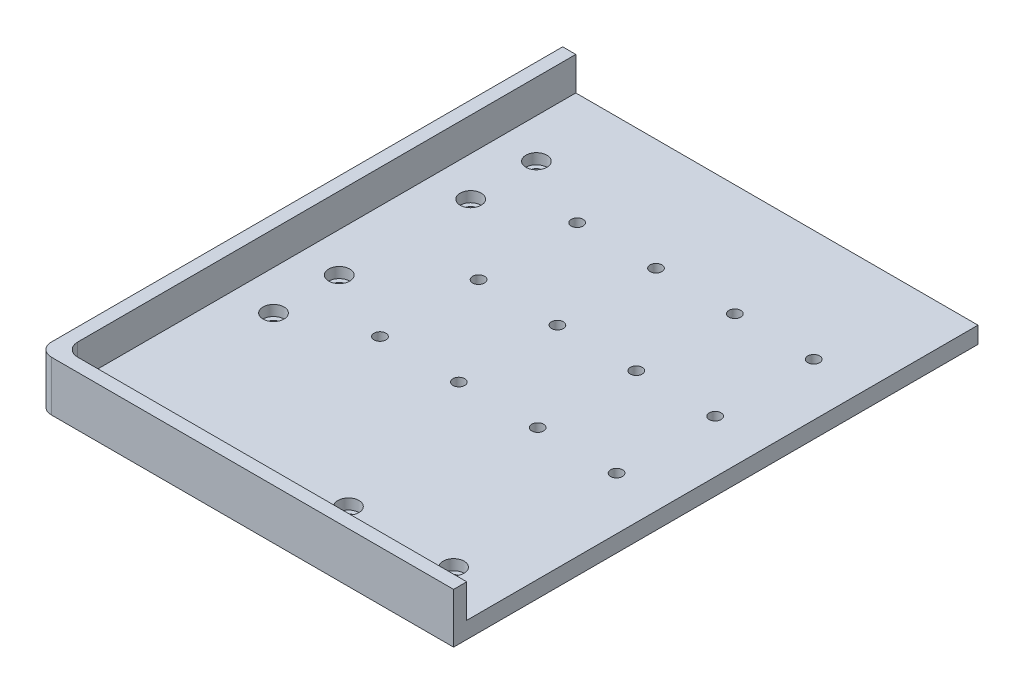
ISO-10303-21;
HEADER;
FILE_DESCRIPTION(('STEP AP214'),'2;1');
FILE_NAME('part.step','',(''),(''),'','','');
FILE_SCHEMA(('AUTOMOTIVE_DESIGN { 1 0 10303 214 1 1 1 1 }'));
ENDSEC;
DATA;
#1=APPLICATION_CONTEXT('core data for automotive mechanical design processes');
#2=APPLICATION_PROTOCOL_DEFINITION('international standard','automotive_design',2000,#1);
#3=PRODUCT_CONTEXT('',#1,'mechanical');
#4=PRODUCT('Part','Part','',(#3));
#5=PRODUCT_RELATED_PRODUCT_CATEGORY('part','',(#4));
#6=PRODUCT_DEFINITION_FORMATION('','',#4);
#7=PRODUCT_DEFINITION_CONTEXT('part definition',#1,'design');
#8=PRODUCT_DEFINITION('design','',#6,#7);
#9=PRODUCT_DEFINITION_SHAPE('','',#8);
#10=(LENGTH_UNIT() NAMED_UNIT(*) SI_UNIT(.MILLI.,.METRE.));
#11=(NAMED_UNIT(*) PLANE_ANGLE_UNIT() SI_UNIT($,.RADIAN.));
#12=(NAMED_UNIT(*) SI_UNIT($,.STERADIAN.) SOLID_ANGLE_UNIT());
#13=UNCERTAINTY_MEASURE_WITH_UNIT(LENGTH_MEASURE(1.E-05),#10,'distance_accuracy_value','');
#14=(GEOMETRIC_REPRESENTATION_CONTEXT(3) GLOBAL_UNCERTAINTY_ASSIGNED_CONTEXT((#13)) GLOBAL_UNIT_ASSIGNED_CONTEXT((#10,
#11,#12)) REPRESENTATION_CONTEXT('',''));
#15=CARTESIAN_POINT('',(0.,0.,0.));
#16=DIRECTION('',(0.,0.,1.));
#17=DIRECTION('',(1.,0.,0.));
#18=AXIS2_PLACEMENT_3D('',#15,#16,#17);
#19=CARTESIAN_POINT('',(48.,6.35,42.5));
#20=DIRECTION('',(0.,1.,0.));
#21=DIRECTION('',(0.,0.,1.));
#22=AXIS2_PLACEMENT_3D('',#19,#20,#21);
#23=CYLINDRICAL_SURFACE('',#22,2.25);
#24=CARTESIAN_POINT('',(48.,0.,42.5));
#25=DIRECTION('',(0.,1.,0.));
#26=DIRECTION('',(0.,0.,1.));
#27=AXIS2_PLACEMENT_3D('',#24,#25,#26);
#28=CIRCLE('',#27,2.25);
#29=CARTESIAN_POINT('',(48.,0.,44.75));
#30=VERTEX_POINT('',#29);
#31=EDGE_CURVE('E219',#30,#30,#28,.T.);
#32=ORIENTED_EDGE('',*,*,#31,.F.);
#33=EDGE_LOOP('',(#32));
#34=FACE_BOUND('',#33,.T.);
#35=CARTESIAN_POINT('',(48.,6.35,42.5));
#36=DIRECTION('',(0.,1.,0.));
#37=DIRECTION('',(0.,0.,1.));
#38=AXIS2_PLACEMENT_3D('',#35,#36,#37);
#39=CIRCLE('',#38,2.25);
#40=CARTESIAN_POINT('',(48.,6.35,44.75));
#41=VERTEX_POINT('',#40);
#42=EDGE_CURVE('E222',#41,#41,#39,.T.);
#43=ORIENTED_EDGE('',*,*,#42,.T.);
#44=EDGE_LOOP('',(#43));
#45=FACE_BOUND('',#44,.T.);
#46=ADVANCED_FACE('F41',(#34,#45),#23,.F.);
#47=CARTESIAN_POINT('',(78.,6.35,42.5));
#48=DIRECTION('',(0.,1.,0.));
#49=DIRECTION('',(0.,0.,1.));
#50=AXIS2_PLACEMENT_3D('',#47,#48,#49);
#51=CYLINDRICAL_SURFACE('',#50,2.25);
#52=CARTESIAN_POINT('',(78.,0.,42.5));
#53=DIRECTION('',(0.,1.,0.));
#54=DIRECTION('',(0.,0.,1.));
#55=AXIS2_PLACEMENT_3D('',#52,#53,#54);
#56=CIRCLE('',#55,2.25);
#57=CARTESIAN_POINT('',(78.,0.,44.75));
#58=VERTEX_POINT('',#57);
#59=EDGE_CURVE('E213',#58,#58,#56,.T.);
#60=ORIENTED_EDGE('',*,*,#59,.F.);
#61=EDGE_LOOP('',(#60));
#62=FACE_BOUND('',#61,.T.);
#63=CARTESIAN_POINT('',(78.,6.35,42.5));
#64=DIRECTION('',(0.,1.,0.));
#65=DIRECTION('',(0.,0.,1.));
#66=AXIS2_PLACEMENT_3D('',#63,#64,#65);
#67=CIRCLE('',#66,2.25);
#68=CARTESIAN_POINT('',(78.,6.35,44.75));
#69=VERTEX_POINT('',#68);
#70=EDGE_CURVE('E216',#69,#69,#67,.T.);
#71=ORIENTED_EDGE('',*,*,#70,.T.);
#72=EDGE_LOOP('',(#71));
#73=FACE_BOUND('',#72,.T.);
#74=ADVANCED_FACE('F251',(#62,#73),#51,.F.);
#75=CARTESIAN_POINT('',(108.,6.35,42.5));
#76=DIRECTION('',(0.,1.,0.));
#77=DIRECTION('',(0.,0.,1.));
#78=AXIS2_PLACEMENT_3D('',#75,#76,#77);
#79=CYLINDRICAL_SURFACE('',#78,2.25);
#80=CARTESIAN_POINT('',(108.,0.,42.5));
#81=DIRECTION('',(0.,1.,0.));
#82=DIRECTION('',(0.,0.,1.));
#83=AXIS2_PLACEMENT_3D('',#80,#81,#82);
#84=CIRCLE('',#83,2.25);
#85=CARTESIAN_POINT('',(108.,0.,44.75));
#86=VERTEX_POINT('',#85);
#87=EDGE_CURVE('E207',#86,#86,#84,.T.);
#88=ORIENTED_EDGE('',*,*,#87,.F.);
#89=EDGE_LOOP('',(#88));
#90=FACE_BOUND('',#89,.T.);
#91=CARTESIAN_POINT('',(108.,6.35,42.5));
#92=DIRECTION('',(0.,1.,0.));
#93=DIRECTION('',(0.,0.,1.));
#94=AXIS2_PLACEMENT_3D('',#91,#92,#93);
#95=CIRCLE('',#94,2.25);
#96=CARTESIAN_POINT('',(108.,6.35,44.75));
#97=VERTEX_POINT('',#96);
#98=EDGE_CURVE('E210',#97,#97,#95,.T.);
#99=ORIENTED_EDGE('',*,*,#98,.T.);
#100=EDGE_LOOP('',(#99));
#101=FACE_BOUND('',#100,.T.);
#102=ADVANCED_FACE('F258',(#90,#101),#79,.F.);
#103=CARTESIAN_POINT('',(138.,6.35,42.5));
#104=DIRECTION('',(0.,1.,0.));
#105=DIRECTION('',(0.,0.,1.));
#106=AXIS2_PLACEMENT_3D('',#103,#104,#105);
#107=CYLINDRICAL_SURFACE('',#106,2.25);
#108=CARTESIAN_POINT('',(138.,0.,42.5));
#109=DIRECTION('',(0.,1.,0.));
#110=DIRECTION('',(0.,0.,1.));
#111=AXIS2_PLACEMENT_3D('',#108,#109,#110);
#112=CIRCLE('',#111,2.25);
#113=CARTESIAN_POINT('',(138.,0.,44.75));
#114=VERTEX_POINT('',#113);
#115=EDGE_CURVE('E201',#114,#114,#112,.T.);
#116=ORIENTED_EDGE('',*,*,#115,.F.);
#117=EDGE_LOOP('',(#116));
#118=FACE_BOUND('',#117,.T.);
#119=CARTESIAN_POINT('',(138.,6.35,42.5));
#120=DIRECTION('',(0.,1.,0.));
#121=DIRECTION('',(0.,0.,1.));
#122=AXIS2_PLACEMENT_3D('',#119,#120,#121);
#123=CIRCLE('',#122,2.25);
#124=CARTESIAN_POINT('',(138.,6.35,44.75));
#125=VERTEX_POINT('',#124);
#126=EDGE_CURVE('E204',#125,#125,#123,.T.);
#127=ORIENTED_EDGE('',*,*,#126,.T.);
#128=EDGE_LOOP('',(#127));
#129=FACE_BOUND('',#128,.T.);
#130=ADVANCED_FACE('F266',(#118,#129),#107,.F.);
#131=CARTESIAN_POINT('',(48.0000000000001,6.35,80.));
#132=DIRECTION('',(0.,1.,0.));
#133=DIRECTION('',(0.,0.,1.));
#134=AXIS2_PLACEMENT_3D('',#131,#132,#133);
#135=CYLINDRICAL_SURFACE('',#134,2.25);
#136=CARTESIAN_POINT('',(48.0000000000001,0.,80.));
#137=DIRECTION('',(0.,1.,0.));
#138=DIRECTION('',(0.,0.,1.));
#139=AXIS2_PLACEMENT_3D('',#136,#137,#138);
#140=CIRCLE('',#139,2.25);
#141=CARTESIAN_POINT('',(48.0000000000001,0.,82.25));
#142=VERTEX_POINT('',#141);
#143=EDGE_CURVE('E195',#142,#142,#140,.T.);
#144=ORIENTED_EDGE('',*,*,#143,.F.);
#145=EDGE_LOOP('',(#144));
#146=FACE_BOUND('',#145,.T.);
#147=CARTESIAN_POINT('',(48.0000000000001,6.35,80.));
#148=DIRECTION('',(0.,1.,0.));
#149=DIRECTION('',(0.,0.,1.));
#150=AXIS2_PLACEMENT_3D('',#147,#148,#149);
#151=CIRCLE('',#150,2.25);
#152=CARTESIAN_POINT('',(48.0000000000001,6.35,82.25));
#153=VERTEX_POINT('',#152);
#154=EDGE_CURVE('E198',#153,#153,#151,.T.);
#155=ORIENTED_EDGE('',*,*,#154,.T.);
#156=EDGE_LOOP('',(#155));
#157=FACE_BOUND('',#156,.T.);
#158=ADVANCED_FACE('F270',(#146,#157),#135,.F.);
#159=CARTESIAN_POINT('',(138.,6.35,80.));
#160=DIRECTION('',(0.,1.,0.));
#161=DIRECTION('',(0.,0.,1.));
#162=AXIS2_PLACEMENT_3D('',#159,#160,#161);
#163=CYLINDRICAL_SURFACE('',#162,2.25);
#164=CARTESIAN_POINT('',(138.,0.,80.));
#165=DIRECTION('',(0.,1.,0.));
#166=DIRECTION('',(0.,0.,1.));
#167=AXIS2_PLACEMENT_3D('',#164,#165,#166);
#168=CIRCLE('',#167,2.25);
#169=CARTESIAN_POINT('',(138.,0.,82.25));
#170=VERTEX_POINT('',#169);
#171=EDGE_CURVE('E189',#170,#170,#168,.T.);
#172=ORIENTED_EDGE('',*,*,#171,.F.);
#173=EDGE_LOOP('',(#172));
#174=FACE_BOUND('',#173,.T.);
#175=CARTESIAN_POINT('',(138.,6.35,80.));
#176=DIRECTION('',(0.,1.,0.));
#177=DIRECTION('',(0.,0.,1.));
#178=AXIS2_PLACEMENT_3D('',#175,#176,#177);
#179=CIRCLE('',#178,2.25);
#180=CARTESIAN_POINT('',(138.,6.35,82.25));
#181=VERTEX_POINT('',#180);
#182=EDGE_CURVE('E192',#181,#181,#179,.T.);
#183=ORIENTED_EDGE('',*,*,#182,.T.);
#184=EDGE_LOOP('',(#183));
#185=FACE_BOUND('',#184,.T.);
#186=ADVANCED_FACE('F274',(#174,#185),#163,.F.);
#187=CARTESIAN_POINT('',(48.0000000000001,6.35,117.5));
#188=DIRECTION('',(0.,1.,0.));
#189=DIRECTION('',(0.,0.,1.));
#190=AXIS2_PLACEMENT_3D('',#187,#188,#189);
#191=CYLINDRICAL_SURFACE('',#190,2.25);
#192=CARTESIAN_POINT('',(48.0000000000001,0.,117.5));
#193=DIRECTION('',(0.,1.,0.));
#194=DIRECTION('',(0.,0.,1.));
#195=AXIS2_PLACEMENT_3D('',#192,#193,#194);
#196=CIRCLE('',#195,2.25);
#197=CARTESIAN_POINT('',(48.0000000000001,0.,119.75));
#198=VERTEX_POINT('',#197);
#199=EDGE_CURVE('E183',#198,#198,#196,.T.);
#200=ORIENTED_EDGE('',*,*,#199,.F.);
#201=EDGE_LOOP('',(#200));
#202=FACE_BOUND('',#201,.T.);
#203=CARTESIAN_POINT('',(48.0000000000001,6.35,117.5));
#204=DIRECTION('',(0.,1.,0.));
#205=DIRECTION('',(0.,0.,1.));
#206=AXIS2_PLACEMENT_3D('',#203,#204,#205);
#207=CIRCLE('',#206,2.25);
#208=CARTESIAN_POINT('',(48.0000000000001,6.35,119.75));
#209=VERTEX_POINT('',#208);
#210=EDGE_CURVE('E186',#209,#209,#207,.T.);
#211=ORIENTED_EDGE('',*,*,#210,.T.);
#212=EDGE_LOOP('',(#211));
#213=FACE_BOUND('',#212,.T.);
#214=ADVANCED_FACE('F278',(#202,#213),#191,.F.);
#215=CARTESIAN_POINT('',(78.0000000000001,6.35,117.5));
#216=DIRECTION('',(0.,1.,0.));
#217=DIRECTION('',(0.,0.,1.));
#218=AXIS2_PLACEMENT_3D('',#215,#216,#217);
#219=CYLINDRICAL_SURFACE('',#218,2.25);
#220=CARTESIAN_POINT('',(78.0000000000001,0.,117.5));
#221=DIRECTION('',(0.,1.,0.));
#222=DIRECTION('',(0.,0.,1.));
#223=AXIS2_PLACEMENT_3D('',#220,#221,#222);
#224=CIRCLE('',#223,2.25);
#225=CARTESIAN_POINT('',(78.0000000000001,0.,119.75));
#226=VERTEX_POINT('',#225);
#227=EDGE_CURVE('E177',#226,#226,#224,.T.);
#228=ORIENTED_EDGE('',*,*,#227,.F.);
#229=EDGE_LOOP('',(#228));
#230=FACE_BOUND('',#229,.T.);
#231=CARTESIAN_POINT('',(78.0000000000001,6.35,117.5));
#232=DIRECTION('',(0.,1.,0.));
#233=DIRECTION('',(0.,0.,1.));
#234=AXIS2_PLACEMENT_3D('',#231,#232,#233);
#235=CIRCLE('',#234,2.25);
#236=CARTESIAN_POINT('',(78.0000000000001,6.35,119.75));
#237=VERTEX_POINT('',#236);
#238=EDGE_CURVE('E180',#237,#237,#235,.T.);
#239=ORIENTED_EDGE('',*,*,#238,.T.);
#240=EDGE_LOOP('',(#239));
#241=FACE_BOUND('',#240,.T.);
#242=ADVANCED_FACE('F282',(#230,#241),#219,.F.);
#243=CARTESIAN_POINT('',(78.0000000000001,6.35,80.));
#244=DIRECTION('',(0.,1.,0.));
#245=DIRECTION('',(0.,0.,1.));
#246=AXIS2_PLACEMENT_3D('',#243,#244,#245);
#247=CYLINDRICAL_SURFACE('',#246,2.25);
#248=CARTESIAN_POINT('',(78.0000000000001,0.,80.));
#249=DIRECTION('',(0.,1.,0.));
#250=DIRECTION('',(0.,0.,1.));
#251=AXIS2_PLACEMENT_3D('',#248,#249,#250);
#252=CIRCLE('',#251,2.25);
#253=CARTESIAN_POINT('',(78.0000000000001,0.,82.25));
#254=VERTEX_POINT('',#253);
#255=EDGE_CURVE('E171',#254,#254,#252,.T.);
#256=ORIENTED_EDGE('',*,*,#255,.F.);
#257=EDGE_LOOP('',(#256));
#258=FACE_BOUND('',#257,.T.);
#259=CARTESIAN_POINT('',(78.0000000000001,6.35,80.));
#260=DIRECTION('',(0.,1.,0.));
#261=DIRECTION('',(0.,0.,1.));
#262=AXIS2_PLACEMENT_3D('',#259,#260,#261);
#263=CIRCLE('',#262,2.25);
#264=CARTESIAN_POINT('',(78.0000000000001,6.35,82.25));
#265=VERTEX_POINT('',#264);
#266=EDGE_CURVE('E174',#265,#265,#263,.T.);
#267=ORIENTED_EDGE('',*,*,#266,.T.);
#268=EDGE_LOOP('',(#267));
#269=FACE_BOUND('',#268,.T.);
#270=ADVANCED_FACE('F286',(#258,#269),#247,.F.);
#271=CARTESIAN_POINT('',(0.,6.35,0.));
#272=DIRECTION('',(1.,0.,0.));
#273=DIRECTION('',(0.,0.,-1.));
#274=AXIS2_PLACEMENT_3D('',#271,#272,#273);
#275=PLANE('',#274);
#276=DIRECTION('',(0.,0.,1.));
#277=VECTOR('',#276,1.);
#278=CARTESIAN_POINT('',(0.,0.,0.));
#279=LINE('',#278,#277);
#280=CARTESIAN_POINT('',(0.,0.,0.));
#281=VERTEX_POINT('',#280);
#282=CARTESIAN_POINT('',(0.,0.,194.5));
#283=VERTEX_POINT('',#282);
#284=EDGE_CURVE('E156',#281,#283,#279,.T.);
#285=ORIENTED_EDGE('',*,*,#284,.T.);
#286=DIRECTION('',(0.,-1.,0.));
#287=VECTOR('',#286,1.);
#288=CARTESIAN_POINT('',(0.,6.35,194.5));
#289=LINE('',#288,#287);
#290=CARTESIAN_POINT('',(0.,19.05,194.5));
#291=VERTEX_POINT('',#290);
#292=EDGE_CURVE('E56',#283,#291,#289,.F.);
#293=ORIENTED_EDGE('',*,*,#292,.T.);
#294=DIRECTION('',(0.,0.,1.));
#295=VECTOR('',#294,1.);
#296=CARTESIAN_POINT('',(0.,19.05,0.));
#297=LINE('',#296,#295);
#298=CARTESIAN_POINT('',(0.,19.05,0.));
#299=VERTEX_POINT('',#298);
#300=EDGE_CURVE('E124',#299,#291,#297,.T.);
#301=ORIENTED_EDGE('',*,*,#300,.F.);
#302=DIRECTION('',(0.,-1.,0.));
#303=VECTOR('',#302,1.);
#304=CARTESIAN_POINT('',(0.,6.35,0.));
#305=LINE('',#304,#303);
#306=EDGE_CURVE('E113',#299,#281,#305,.T.);
#307=ORIENTED_EDGE('',*,*,#306,.T.);
#308=EDGE_LOOP('',(#285,#293,#301,#307));
#309=FACE_BOUND('',#308,.T.);
#310=ADVANCED_FACE('F125',(#309),#275,.F.);
#311=CARTESIAN_POINT('',(0.,6.35,199.5));
#312=DIRECTION('',(0.,0.,-1.));
#313=DIRECTION('',(-1.,0.,0.));
#314=AXIS2_PLACEMENT_3D('',#311,#312,#313);
#315=PLANE('',#314);
#316=DIRECTION('',(1.,0.,0.));
#317=VECTOR('',#316,1.);
#318=CARTESIAN_POINT('',(0.,19.05,199.5));
#319=LINE('',#318,#317);
#320=CARTESIAN_POINT('',(5.00000000000005,19.05,199.5));
#321=VERTEX_POINT('',#320);
#322=CARTESIAN_POINT('',(158.,19.05,199.5));
#323=VERTEX_POINT('',#322);
#324=EDGE_CURVE('E128',#321,#323,#319,.T.);
#325=ORIENTED_EDGE('',*,*,#324,.F.);
#326=DIRECTION('',(0.,-1.,0.));
#327=VECTOR('',#326,1.);
#328=CARTESIAN_POINT('',(5.00000000000005,6.35,199.5));
#329=LINE('',#328,#327);
#330=CARTESIAN_POINT('',(5.00000000000005,0.,199.5));
#331=VERTEX_POINT('',#330);
#332=EDGE_CURVE('E232',#321,#331,#329,.T.);
#333=ORIENTED_EDGE('',*,*,#332,.T.);
#334=DIRECTION('',(1.,0.,0.));
#335=VECTOR('',#334,1.);
#336=CARTESIAN_POINT('',(0.,0.,199.5));
#337=LINE('',#336,#335);
#338=CARTESIAN_POINT('',(158.,0.,199.5));
#339=VERTEX_POINT('',#338);
#340=EDGE_CURVE('E162',#331,#339,#337,.T.);
#341=ORIENTED_EDGE('',*,*,#340,.T.);
#342=DIRECTION('',(0.,-1.,0.));
#343=VECTOR('',#342,1.);
#344=CARTESIAN_POINT('',(158.,6.35,199.5));
#345=LINE('',#344,#343);
#346=EDGE_CURVE('E168',#323,#339,#345,.T.);
#347=ORIENTED_EDGE('',*,*,#346,.F.);
#348=EDGE_LOOP('',(#325,#333,#341,#347));
#349=FACE_BOUND('',#348,.T.);
#350=ADVANCED_FACE('F241',(#349),#315,.F.);
#351=CARTESIAN_POINT('',(158.,6.35,0.));
#352=DIRECTION('',(-1.,0.,0.));
#353=DIRECTION('',(0.,0.,1.));
#354=AXIS2_PLACEMENT_3D('',#351,#352,#353);
#355=PLANE('',#354);
#356=DIRECTION('',(0.,0.,-1.));
#357=VECTOR('',#356,1.);
#358=CARTESIAN_POINT('',(158.,0.,0.));
#359=LINE('',#358,#357);
#360=CARTESIAN_POINT('',(158.,0.,0.));
#361=VERTEX_POINT('',#360);
#362=EDGE_CURVE('E164',#339,#361,#359,.T.);
#363=ORIENTED_EDGE('',*,*,#362,.T.);
#364=DIRECTION('',(0.,-1.,0.));
#365=VECTOR('',#364,1.);
#366=CARTESIAN_POINT('',(158.,6.35,0.));
#367=LINE('',#366,#365);
#368=CARTESIAN_POINT('',(158.,6.35,0.));
#369=VERTEX_POINT('',#368);
#370=EDGE_CURVE('E121',#369,#361,#367,.T.);
#371=ORIENTED_EDGE('',*,*,#370,.F.);
#372=DIRECTION('',(0.,0.,-1.));
#373=VECTOR('',#372,1.);
#374=CARTESIAN_POINT('',(158.,6.35,0.));
#375=LINE('',#374,#373);
#376=CARTESIAN_POINT('',(158.,6.35,194.5));
#377=VERTEX_POINT('',#376);
#378=EDGE_CURVE('E157',#377,#369,#375,.T.);
#379=ORIENTED_EDGE('',*,*,#378,.F.);
#380=DIRECTION('',(0.,-1.,0.));
#381=VECTOR('',#380,1.);
#382=CARTESIAN_POINT('',(158.,19.05,194.5));
#383=LINE('',#382,#381);
#384=CARTESIAN_POINT('',(158.,19.05,194.5));
#385=VERTEX_POINT('',#384);
#386=EDGE_CURVE('E153',#385,#377,#383,.T.);
#387=ORIENTED_EDGE('',*,*,#386,.F.);
#388=DIRECTION('',(0.,0.,-1.));
#389=VECTOR('',#388,1.);
#390=CARTESIAN_POINT('',(158.,19.05,199.5));
#391=LINE('',#390,#389);
#392=EDGE_CURVE('E143',#323,#385,#391,.T.);
#393=ORIENTED_EDGE('',*,*,#392,.F.);
#394=ORIENTED_EDGE('',*,*,#346,.T.);
#395=EDGE_LOOP('',(#363,#371,#379,#387,#393,#394));
#396=FACE_BOUND('',#395,.T.);
#397=ADVANCED_FACE('F295',(#396),#355,.F.);
#398=CARTESIAN_POINT('',(0.,6.35,0.));
#399=DIRECTION('',(0.,0.,1.));
#400=DIRECTION('',(1.,0.,0.));
#401=AXIS2_PLACEMENT_3D('',#398,#399,#400);
#402=PLANE('',#401);
#403=DIRECTION('',(-1.,0.,0.));
#404=VECTOR('',#403,1.);
#405=CARTESIAN_POINT('',(0.,0.,0.));
#406=LINE('',#405,#404);
#407=EDGE_CURVE('E120',#361,#281,#406,.T.);
#408=ORIENTED_EDGE('',*,*,#407,.T.);
#409=ORIENTED_EDGE('',*,*,#306,.F.);
#410=DIRECTION('',(-1.,0.,0.));
#411=VECTOR('',#410,1.);
#412=CARTESIAN_POINT('',(0.,19.05,0.));
#413=LINE('',#412,#411);
#414=CARTESIAN_POINT('',(5.,19.05,0.));
#415=VERTEX_POINT('',#414);
#416=EDGE_CURVE('E117',#415,#299,#413,.T.);
#417=ORIENTED_EDGE('',*,*,#416,.F.);
#418=DIRECTION('',(0.,-1.,0.));
#419=VECTOR('',#418,1.);
#420=CARTESIAN_POINT('',(5.,19.05,0.));
#421=LINE('',#420,#419);
#422=CARTESIAN_POINT('',(5.,6.35,0.));
#423=VERTEX_POINT('',#422);
#424=EDGE_CURVE('E149',#415,#423,#421,.T.);
#425=ORIENTED_EDGE('',*,*,#424,.T.);
#426=DIRECTION('',(-1.,0.,0.));
#427=VECTOR('',#426,1.);
#428=CARTESIAN_POINT('',(0.,6.35,0.));
#429=LINE('',#428,#427);
#430=EDGE_CURVE('E122',#369,#423,#429,.T.);
#431=ORIENTED_EDGE('',*,*,#430,.F.);
#432=ORIENTED_EDGE('',*,*,#370,.T.);
#433=EDGE_LOOP('',(#408,#409,#417,#425,#431,#432));
#434=FACE_BOUND('',#433,.T.);
#435=ADVANCED_FACE('F114',(#434),#402,.F.);
#436=CARTESIAN_POINT('',(0.,6.35,0.));
#437=DIRECTION('',(0.,1.,0.));
#438=DIRECTION('',(0.,0.,1.));
#439=AXIS2_PLACEMENT_3D('',#436,#437,#438);
#440=PLANE('',#439);
#441=CARTESIAN_POINT('',(108.,6.35,117.5));
#442=DIRECTION('',(0.,1.,0.));
#443=DIRECTION('',(0.,0.,1.));
#444=AXIS2_PLACEMENT_3D('',#441,#442,#443);
#445=CIRCLE('',#444,2.25);
#446=CARTESIAN_POINT('',(108.,6.35,119.75));
#447=VERTEX_POINT('',#446);
#448=EDGE_CURVE('E408',#447,#447,#445,.T.);
#449=ORIENTED_EDGE('',*,*,#448,.F.);
#450=EDGE_LOOP('',(#449));
#451=FACE_BOUND('',#450,.T.);
#452=CARTESIAN_POINT('',(108.,6.35,80.));
#453=DIRECTION('',(0.,1.,0.));
#454=DIRECTION('',(0.,0.,1.));
#455=AXIS2_PLACEMENT_3D('',#452,#453,#454);
#456=CIRCLE('',#455,2.25);
#457=CARTESIAN_POINT('',(108.,6.35,82.25));
#458=VERTEX_POINT('',#457);
#459=EDGE_CURVE('E412',#458,#458,#456,.T.);
#460=ORIENTED_EDGE('',*,*,#459,.F.);
#461=EDGE_LOOP('',(#460));
#462=FACE_BOUND('',#461,.T.);
#463=CARTESIAN_POINT('',(138.,6.35,117.5));
#464=DIRECTION('',(0.,1.,0.));
#465=DIRECTION('',(0.,0.,1.));
#466=AXIS2_PLACEMENT_3D('',#463,#464,#465);
#467=CIRCLE('',#466,2.25);
#468=CARTESIAN_POINT('',(138.,6.35,119.75));
#469=VERTEX_POINT('',#468);
#470=EDGE_CURVE('E418',#469,#469,#467,.T.);
#471=ORIENTED_EDGE('',*,*,#470,.F.);
#472=EDGE_LOOP('',(#471));
#473=FACE_BOUND('',#472,.T.);
#474=CARTESIAN_POINT('',(98.,6.35,179.5));
#475=DIRECTION('',(0.,1.,0.));
#476=DIRECTION('',(0.,0.,1.));
#477=AXIS2_PLACEMENT_3D('',#474,#475,#476);
#478=CIRCLE('',#477,4.);
#479=CARTESIAN_POINT('',(98.,6.35,183.5));
#480=VERTEX_POINT('',#479);
#481=EDGE_CURVE('E424',#480,#480,#478,.T.);
#482=ORIENTED_EDGE('',*,*,#481,.F.);
#483=EDGE_LOOP('',(#482));
#484=FACE_BOUND('',#483,.T.);
#485=CARTESIAN_POINT('',(138.,6.35,179.5));
#486=DIRECTION('',(0.,1.,0.));
#487=DIRECTION('',(0.,0.,1.));
#488=AXIS2_PLACEMENT_3D('',#485,#486,#487);
#489=CIRCLE('',#488,4.);
#490=CARTESIAN_POINT('',(138.,6.35,183.5));
#491=VERTEX_POINT('',#490);
#492=EDGE_CURVE('E436',#491,#491,#489,.T.);
#493=ORIENTED_EDGE('',*,*,#492,.F.);
#494=EDGE_LOOP('',(#493));
#495=FACE_BOUND('',#494,.T.);
#496=CARTESIAN_POINT('',(20.,6.35,130.));
#497=DIRECTION('',(0.,1.,0.));
#498=DIRECTION('',(0.,0.,1.));
#499=AXIS2_PLACEMENT_3D('',#496,#497,#498);
#500=CIRCLE('',#499,4.);
#501=CARTESIAN_POINT('',(20.,6.35,134.));
#502=VERTEX_POINT('',#501);
#503=EDGE_CURVE('E448',#502,#502,#500,.T.);
#504=ORIENTED_EDGE('',*,*,#503,.F.);
#505=EDGE_LOOP('',(#504));
#506=FACE_BOUND('',#505,.T.);
#507=CARTESIAN_POINT('',(20.,6.35,105.));
#508=DIRECTION('',(0.,1.,0.));
#509=DIRECTION('',(0.,0.,1.));
#510=AXIS2_PLACEMENT_3D('',#507,#508,#509);
#511=CIRCLE('',#510,4.);
#512=CARTESIAN_POINT('',(20.,6.35,109.));
#513=VERTEX_POINT('',#512);
#514=EDGE_CURVE('E460',#513,#513,#511,.T.);
#515=ORIENTED_EDGE('',*,*,#514,.F.);
#516=EDGE_LOOP('',(#515));
#517=FACE_BOUND('',#516,.T.);
#518=CARTESIAN_POINT('',(20.,6.35,30.));
#519=DIRECTION('',(0.,1.,0.));
#520=DIRECTION('',(0.,0.,1.));
#521=AXIS2_PLACEMENT_3D('',#518,#519,#520);
#522=CIRCLE('',#521,4.);
#523=CARTESIAN_POINT('',(20.,6.35,34.));
#524=VERTEX_POINT('',#523);
#525=EDGE_CURVE('E472',#524,#524,#522,.T.);
#526=ORIENTED_EDGE('',*,*,#525,.F.);
#527=EDGE_LOOP('',(#526));
#528=FACE_BOUND('',#527,.T.);
#529=CARTESIAN_POINT('',(20.,6.35,55.));
#530=DIRECTION('',(0.,1.,0.));
#531=DIRECTION('',(0.,0.,1.));
#532=AXIS2_PLACEMENT_3D('',#529,#530,#531);
#533=CIRCLE('',#532,4.);
#534=CARTESIAN_POINT('',(20.,6.35,59.));
#535=VERTEX_POINT('',#534);
#536=EDGE_CURVE('E484',#535,#535,#533,.T.);
#537=ORIENTED_EDGE('',*,*,#536,.F.);
#538=EDGE_LOOP('',(#537));
#539=FACE_BOUND('',#538,.T.);
#540=DIRECTION('',(0.,0.,-1.));
#541=VECTOR('',#540,1.);
#542=CARTESIAN_POINT('',(5.,6.35,0.));
#543=LINE('',#542,#541);
#544=CARTESIAN_POINT('',(5.,6.35,189.5));
#545=VERTEX_POINT('',#544);
#546=EDGE_CURVE('E134',#545,#423,#543,.T.);
#547=ORIENTED_EDGE('',*,*,#546,.F.);
#548=CARTESIAN_POINT('',(10.,6.35,189.5));
#549=DIRECTION('',(0.,1.,0.));
#550=DIRECTION('',(0.,0.,1.));
#551=AXIS2_PLACEMENT_3D('',#548,#549,#550);
#552=CIRCLE('',#551,5.);
#553=CARTESIAN_POINT('',(10.,6.35,194.5));
#554=VERTEX_POINT('',#553);
#555=EDGE_CURVE('E228',#545,#554,#552,.T.);
#556=ORIENTED_EDGE('',*,*,#555,.T.);
#557=DIRECTION('',(-1.,0.,0.));
#558=VECTOR('',#557,1.);
#559=CARTESIAN_POINT('',(5.,6.35,194.5));
#560=LINE('',#559,#558);
#561=EDGE_CURVE('E136',#377,#554,#560,.T.);
#562=ORIENTED_EDGE('',*,*,#561,.F.);
#563=ORIENTED_EDGE('',*,*,#378,.T.);
#564=ORIENTED_EDGE('',*,*,#430,.T.);
#565=EDGE_LOOP('',(#547,#556,#562,#563,#564));
#566=FACE_BOUND('',#565,.T.);
#567=ORIENTED_EDGE('',*,*,#266,.F.);
#568=EDGE_LOOP('',(#567));
#569=FACE_BOUND('',#568,.T.);
#570=ORIENTED_EDGE('',*,*,#238,.F.);
#571=EDGE_LOOP('',(#570));
#572=FACE_BOUND('',#571,.T.);
#573=ORIENTED_EDGE('',*,*,#210,.F.);
#574=EDGE_LOOP('',(#573));
#575=FACE_BOUND('',#574,.T.);
#576=ORIENTED_EDGE('',*,*,#182,.F.);
#577=EDGE_LOOP('',(#576));
#578=FACE_BOUND('',#577,.T.);
#579=ORIENTED_EDGE('',*,*,#154,.F.);
#580=EDGE_LOOP('',(#579));
#581=FACE_BOUND('',#580,.T.);
#582=ORIENTED_EDGE('',*,*,#126,.F.);
#583=EDGE_LOOP('',(#582));
#584=FACE_BOUND('',#583,.T.);
#585=ORIENTED_EDGE('',*,*,#98,.F.);
#586=EDGE_LOOP('',(#585));
#587=FACE_BOUND('',#586,.T.);
#588=ORIENTED_EDGE('',*,*,#70,.F.);
#589=EDGE_LOOP('',(#588));
#590=FACE_BOUND('',#589,.T.);
#591=ORIENTED_EDGE('',*,*,#42,.F.);
#592=EDGE_LOOP('',(#591));
#593=FACE_BOUND('',#592,.T.);
#594=ADVANCED_FACE('F301',(#451,#462,#473,#484,#495,#506,#517,#528,#539,#566,#569,#572,#575,
#578,#581,#584,#587,#590,#593),#440,.T.);
#595=CARTESIAN_POINT('',(0.,0.,0.));
#596=DIRECTION('',(0.,1.,0.));
#597=DIRECTION('',(0.,0.,1.));
#598=AXIS2_PLACEMENT_3D('',#595,#596,#597);
#599=PLANE('',#598);
#600=CARTESIAN_POINT('',(108.,0.,117.5));
#601=DIRECTION('',(0.,1.,0.));
#602=DIRECTION('',(0.,0.,1.));
#603=AXIS2_PLACEMENT_3D('',#600,#601,#602);
#604=CIRCLE('',#603,2.25);
#605=CARTESIAN_POINT('',(108.,0.,119.75));
#606=VERTEX_POINT('',#605);
#607=EDGE_CURVE('E405',#606,#606,#604,.T.);
#608=ORIENTED_EDGE('',*,*,#607,.T.);
#609=EDGE_LOOP('',(#608));
#610=FACE_BOUND('',#609,.T.);
#611=CARTESIAN_POINT('',(108.,0.,80.));
#612=DIRECTION('',(0.,1.,0.));
#613=DIRECTION('',(0.,0.,1.));
#614=AXIS2_PLACEMENT_3D('',#611,#612,#613);
#615=CIRCLE('',#614,2.25);
#616=CARTESIAN_POINT('',(108.,0.,82.25));
#617=VERTEX_POINT('',#616);
#618=EDGE_CURVE('E409',#617,#617,#615,.T.);
#619=ORIENTED_EDGE('',*,*,#618,.T.);
#620=EDGE_LOOP('',(#619));
#621=FACE_BOUND('',#620,.T.);
#622=CARTESIAN_POINT('',(138.,0.,117.5));
#623=DIRECTION('',(0.,1.,0.));
#624=DIRECTION('',(0.,0.,1.));
#625=AXIS2_PLACEMENT_3D('',#622,#623,#624);
#626=CIRCLE('',#625,2.25);
#627=CARTESIAN_POINT('',(138.,0.,119.75));
#628=VERTEX_POINT('',#627);
#629=EDGE_CURVE('E421',#628,#628,#626,.T.);
#630=ORIENTED_EDGE('',*,*,#629,.T.);
#631=EDGE_LOOP('',(#630));
#632=FACE_BOUND('',#631,.T.);
#633=CARTESIAN_POINT('',(98.,0.,179.5));
#634=DIRECTION('',(0.,1.,0.));
#635=DIRECTION('',(0.,0.,1.));
#636=AXIS2_PLACEMENT_3D('',#633,#634,#635);
#637=CIRCLE('',#636,2.25);
#638=CARTESIAN_POINT('',(98.,0.,181.75));
#639=VERTEX_POINT('',#638);
#640=EDGE_CURVE('E433',#639,#639,#637,.T.);
#641=ORIENTED_EDGE('',*,*,#640,.T.);
#642=EDGE_LOOP('',(#641));
#643=FACE_BOUND('',#642,.T.);
#644=CARTESIAN_POINT('',(138.,0.,179.5));
#645=DIRECTION('',(0.,1.,0.));
#646=DIRECTION('',(0.,0.,1.));
#647=AXIS2_PLACEMENT_3D('',#644,#645,#646);
#648=CIRCLE('',#647,2.25);
#649=CARTESIAN_POINT('',(138.,0.,181.75));
#650=VERTEX_POINT('',#649);
#651=EDGE_CURVE('E445',#650,#650,#648,.T.);
#652=ORIENTED_EDGE('',*,*,#651,.T.);
#653=EDGE_LOOP('',(#652));
#654=FACE_BOUND('',#653,.T.);
#655=CARTESIAN_POINT('',(20.,0.,130.));
#656=DIRECTION('',(0.,1.,0.));
#657=DIRECTION('',(0.,0.,1.));
#658=AXIS2_PLACEMENT_3D('',#655,#656,#657);
#659=CIRCLE('',#658,2.25);
#660=CARTESIAN_POINT('',(20.,0.,132.25));
#661=VERTEX_POINT('',#660);
#662=EDGE_CURVE('E457',#661,#661,#659,.T.);
#663=ORIENTED_EDGE('',*,*,#662,.T.);
#664=EDGE_LOOP('',(#663));
#665=FACE_BOUND('',#664,.T.);
#666=CARTESIAN_POINT('',(20.,0.,105.));
#667=DIRECTION('',(0.,1.,0.));
#668=DIRECTION('',(0.,0.,1.));
#669=AXIS2_PLACEMENT_3D('',#666,#667,#668);
#670=CIRCLE('',#669,2.25);
#671=CARTESIAN_POINT('',(20.,0.,107.25));
#672=VERTEX_POINT('',#671);
#673=EDGE_CURVE('E469',#672,#672,#670,.T.);
#674=ORIENTED_EDGE('',*,*,#673,.T.);
#675=EDGE_LOOP('',(#674));
#676=FACE_BOUND('',#675,.T.);
#677=CARTESIAN_POINT('',(20.,0.,30.));
#678=DIRECTION('',(0.,1.,0.));
#679=DIRECTION('',(0.,0.,1.));
#680=AXIS2_PLACEMENT_3D('',#677,#678,#679);
#681=CIRCLE('',#680,2.25);
#682=CARTESIAN_POINT('',(20.,0.,32.25));
#683=VERTEX_POINT('',#682);
#684=EDGE_CURVE('E481',#683,#683,#681,.T.);
#685=ORIENTED_EDGE('',*,*,#684,.T.);
#686=EDGE_LOOP('',(#685));
#687=FACE_BOUND('',#686,.T.);
#688=CARTESIAN_POINT('',(20.,0.,55.));
#689=DIRECTION('',(0.,1.,0.));
#690=DIRECTION('',(0.,0.,1.));
#691=AXIS2_PLACEMENT_3D('',#688,#689,#690);
#692=CIRCLE('',#691,2.25);
#693=CARTESIAN_POINT('',(20.,0.,57.25));
#694=VERTEX_POINT('',#693);
#695=EDGE_CURVE('E139',#694,#694,#692,.T.);
#696=ORIENTED_EDGE('',*,*,#695,.T.);
#697=EDGE_LOOP('',(#696));
#698=FACE_BOUND('',#697,.T.);
#699=ORIENTED_EDGE('',*,*,#340,.F.);
#700=CARTESIAN_POINT('',(5.00000000000005,0.,194.5));
#701=DIRECTION('',(0.,1.,0.));
#702=DIRECTION('',(0.,0.,1.));
#703=AXIS2_PLACEMENT_3D('',#700,#701,#702);
#704=CIRCLE('',#703,5.);
#705=EDGE_CURVE('E64',#331,#283,#704,.F.);
#706=ORIENTED_EDGE('',*,*,#705,.T.);
#707=ORIENTED_EDGE('',*,*,#284,.F.);
#708=ORIENTED_EDGE('',*,*,#407,.F.);
#709=ORIENTED_EDGE('',*,*,#362,.F.);
#710=EDGE_LOOP('',(#699,#706,#707,#708,#709));
#711=FACE_BOUND('',#710,.T.);
#712=ORIENTED_EDGE('',*,*,#255,.T.);
#713=EDGE_LOOP('',(#712));
#714=FACE_BOUND('',#713,.T.);
#715=ORIENTED_EDGE('',*,*,#227,.T.);
#716=EDGE_LOOP('',(#715));
#717=FACE_BOUND('',#716,.T.);
#718=ORIENTED_EDGE('',*,*,#199,.T.);
#719=EDGE_LOOP('',(#718));
#720=FACE_BOUND('',#719,.T.);
#721=ORIENTED_EDGE('',*,*,#171,.T.);
#722=EDGE_LOOP('',(#721));
#723=FACE_BOUND('',#722,.T.);
#724=ORIENTED_EDGE('',*,*,#143,.T.);
#725=EDGE_LOOP('',(#724));
#726=FACE_BOUND('',#725,.T.);
#727=ORIENTED_EDGE('',*,*,#115,.T.);
#728=EDGE_LOOP('',(#727));
#729=FACE_BOUND('',#728,.T.);
#730=ORIENTED_EDGE('',*,*,#87,.T.);
#731=EDGE_LOOP('',(#730));
#732=FACE_BOUND('',#731,.T.);
#733=ORIENTED_EDGE('',*,*,#59,.T.);
#734=EDGE_LOOP('',(#733));
#735=FACE_BOUND('',#734,.T.);
#736=ORIENTED_EDGE('',*,*,#31,.T.);
#737=EDGE_LOOP('',(#736));
#738=FACE_BOUND('',#737,.T.);
#739=ADVANCED_FACE('F302',(#610,#621,#632,#643,#654,#665,#676,#687,#698,#711,#714,#717,#720,
#723,#726,#729,#732,#735,#738),#599,.F.);
#740=CARTESIAN_POINT('',(5.,19.05,194.5));
#741=DIRECTION('',(0.,0.,1.));
#742=DIRECTION('',(1.,0.,0.));
#743=AXIS2_PLACEMENT_3D('',#740,#741,#742);
#744=PLANE('',#743);
#745=ORIENTED_EDGE('',*,*,#561,.T.);
#746=DIRECTION('',(0.,-1.,0.));
#747=VECTOR('',#746,1.);
#748=CARTESIAN_POINT('',(10.,19.05,194.5));
#749=LINE('',#748,#747);
#750=CARTESIAN_POINT('',(10.,19.05,194.5));
#751=VERTEX_POINT('',#750);
#752=EDGE_CURVE('E230',#554,#751,#749,.F.);
#753=ORIENTED_EDGE('',*,*,#752,.T.);
#754=DIRECTION('',(-1.,0.,0.));
#755=VECTOR('',#754,1.);
#756=CARTESIAN_POINT('',(5.,19.05,194.5));
#757=LINE('',#756,#755);
#758=EDGE_CURVE('E145',#385,#751,#757,.T.);
#759=ORIENTED_EDGE('',*,*,#758,.F.);
#760=ORIENTED_EDGE('',*,*,#386,.T.);
#761=EDGE_LOOP('',(#745,#753,#759,#760));
#762=FACE_BOUND('',#761,.T.);
#763=ADVANCED_FACE('F305',(#762),#744,.F.);
#764=CARTESIAN_POINT('',(5.,19.05,0.));
#765=DIRECTION('',(-1.,0.,0.));
#766=DIRECTION('',(0.,0.,1.));
#767=AXIS2_PLACEMENT_3D('',#764,#765,#766);
#768=PLANE('',#767);
#769=DIRECTION('',(0.,0.,-1.));
#770=VECTOR('',#769,1.);
#771=CARTESIAN_POINT('',(5.,19.05,0.));
#772=LINE('',#771,#770);
#773=CARTESIAN_POINT('',(5.,19.05,189.5));
#774=VERTEX_POINT('',#773);
#775=EDGE_CURVE('E132',#774,#415,#772,.T.);
#776=ORIENTED_EDGE('',*,*,#775,.F.);
#777=DIRECTION('',(0.,-1.,0.));
#778=VECTOR('',#777,1.);
#779=CARTESIAN_POINT('',(5.,6.35,189.5));
#780=LINE('',#779,#778);
#781=EDGE_CURVE('E225',#774,#545,#780,.T.);
#782=ORIENTED_EDGE('',*,*,#781,.T.);
#783=ORIENTED_EDGE('',*,*,#546,.T.);
#784=ORIENTED_EDGE('',*,*,#424,.F.);
#785=EDGE_LOOP('',(#776,#782,#783,#784));
#786=FACE_BOUND('',#785,.T.);
#787=ADVANCED_FACE('F312',(#786),#768,.F.);
#788=CARTESIAN_POINT('',(0.,19.05,0.));
#789=DIRECTION('',(0.,-1.,0.));
#790=DIRECTION('',(0.,0.,-1.));
#791=AXIS2_PLACEMENT_3D('',#788,#789,#790);
#792=PLANE('',#791);
#793=ORIENTED_EDGE('',*,*,#300,.T.);
#794=CARTESIAN_POINT('',(5.00000000000005,19.05,194.5));
#795=DIRECTION('',(0.,-1.,0.));
#796=DIRECTION('',(0.,0.,-1.));
#797=AXIS2_PLACEMENT_3D('',#794,#795,#796);
#798=CIRCLE('',#797,5.);
#799=EDGE_CURVE('E49',#291,#321,#798,.F.);
#800=ORIENTED_EDGE('',*,*,#799,.T.);
#801=ORIENTED_EDGE('',*,*,#324,.T.);
#802=ORIENTED_EDGE('',*,*,#392,.T.);
#803=ORIENTED_EDGE('',*,*,#758,.T.);
#804=CARTESIAN_POINT('',(10.,19.05,189.5));
#805=DIRECTION('',(0.,-1.,0.));
#806=DIRECTION('',(0.,0.,-1.));
#807=AXIS2_PLACEMENT_3D('',#804,#805,#806);
#808=CIRCLE('',#807,5.);
#809=EDGE_CURVE('E11',#751,#774,#808,.T.);
#810=ORIENTED_EDGE('',*,*,#809,.T.);
#811=ORIENTED_EDGE('',*,*,#775,.T.);
#812=ORIENTED_EDGE('',*,*,#416,.T.);
#813=EDGE_LOOP('',(#793,#800,#801,#802,#803,#810,#811,#812));
#814=FACE_BOUND('',#813,.T.);
#815=ADVANCED_FACE('F130',(#814),#792,.F.);
#816=CARTESIAN_POINT('',(20.,6.35,55.));
#817=DIRECTION('',(0.,1.,0.));
#818=DIRECTION('',(0.,0.,1.));
#819=AXIS2_PLACEMENT_3D('',#816,#817,#818);
#820=CYLINDRICAL_SURFACE('',#819,2.25);
#821=ORIENTED_EDGE('',*,*,#695,.F.);
#822=EDGE_LOOP('',(#821));
#823=FACE_BOUND('',#822,.T.);
#824=CARTESIAN_POINT('',(20.,2.35,55.));
#825=DIRECTION('',(0.,1.,0.));
#826=DIRECTION('',(0.,0.,1.));
#827=AXIS2_PLACEMENT_3D('',#824,#825,#826);
#828=CIRCLE('',#827,2.25);
#829=CARTESIAN_POINT('',(20.,2.35,57.25));
#830=VERTEX_POINT('',#829);
#831=EDGE_CURVE('E489',#830,#830,#828,.T.);
#832=ORIENTED_EDGE('',*,*,#831,.T.);
#833=EDGE_LOOP('',(#832));
#834=FACE_BOUND('',#833,.T.);
#835=ADVANCED_FACE('F319',(#823,#834),#820,.F.);
#836=CARTESIAN_POINT('',(22.25,2.35,55.));
#837=DIRECTION('',(0.,-1.,0.));
#838=DIRECTION('',(0.,0.,-1.));
#839=AXIS2_PLACEMENT_3D('',#836,#837,#838);
#840=PLANE('',#839);
#841=ORIENTED_EDGE('',*,*,#831,.F.);
#842=EDGE_LOOP('',(#841));
#843=FACE_BOUND('',#842,.T.);
#844=CARTESIAN_POINT('',(20.,2.35,55.));
#845=DIRECTION('',(0.,1.,0.));
#846=DIRECTION('',(0.,0.,1.));
#847=AXIS2_PLACEMENT_3D('',#844,#845,#846);
#848=CIRCLE('',#847,4.);
#849=CARTESIAN_POINT('',(20.,2.35,59.));
#850=VERTEX_POINT('',#849);
#851=EDGE_CURVE('E487',#850,#850,#848,.T.);
#852=ORIENTED_EDGE('',*,*,#851,.T.);
#853=EDGE_LOOP('',(#852));
#854=FACE_BOUND('',#853,.T.);
#855=ADVANCED_FACE('F322',(#843,#854),#840,.F.);
#856=CARTESIAN_POINT('',(20.,6.35,55.));
#857=DIRECTION('',(0.,1.,0.));
#858=DIRECTION('',(0.,0.,1.));
#859=AXIS2_PLACEMENT_3D('',#856,#857,#858);
#860=CYLINDRICAL_SURFACE('',#859,4.);
#861=ORIENTED_EDGE('',*,*,#851,.F.);
#862=EDGE_LOOP('',(#861));
#863=FACE_BOUND('',#862,.T.);
#864=ORIENTED_EDGE('',*,*,#536,.T.);
#865=EDGE_LOOP('',(#864));
#866=FACE_BOUND('',#865,.T.);
#867=ADVANCED_FACE('F326',(#863,#866),#860,.F.);
#868=CARTESIAN_POINT('',(20.,6.35,30.));
#869=DIRECTION('',(0.,1.,0.));
#870=DIRECTION('',(0.,0.,1.));
#871=AXIS2_PLACEMENT_3D('',#868,#869,#870);
#872=CYLINDRICAL_SURFACE('',#871,2.25);
#873=ORIENTED_EDGE('',*,*,#684,.F.);
#874=EDGE_LOOP('',(#873));
#875=FACE_BOUND('',#874,.T.);
#876=CARTESIAN_POINT('',(20.,2.35,30.));
#877=DIRECTION('',(0.,1.,0.));
#878=DIRECTION('',(0.,0.,1.));
#879=AXIS2_PLACEMENT_3D('',#876,#877,#878);
#880=CIRCLE('',#879,2.25);
#881=CARTESIAN_POINT('',(20.,2.35,32.25));
#882=VERTEX_POINT('',#881);
#883=EDGE_CURVE('E478',#882,#882,#880,.T.);
#884=ORIENTED_EDGE('',*,*,#883,.T.);
#885=EDGE_LOOP('',(#884));
#886=FACE_BOUND('',#885,.T.);
#887=ADVANCED_FACE('F330',(#875,#886),#872,.F.);
#888=CARTESIAN_POINT('',(22.25,2.35,30.));
#889=DIRECTION('',(0.,-1.,0.));
#890=DIRECTION('',(0.,0.,-1.));
#891=AXIS2_PLACEMENT_3D('',#888,#889,#890);
#892=PLANE('',#891);
#893=ORIENTED_EDGE('',*,*,#883,.F.);
#894=EDGE_LOOP('',(#893));
#895=FACE_BOUND('',#894,.T.);
#896=CARTESIAN_POINT('',(20.,2.35,30.));
#897=DIRECTION('',(0.,1.,0.));
#898=DIRECTION('',(0.,0.,1.));
#899=AXIS2_PLACEMENT_3D('',#896,#897,#898);
#900=CIRCLE('',#899,4.);
#901=CARTESIAN_POINT('',(20.,2.35,34.));
#902=VERTEX_POINT('',#901);
#903=EDGE_CURVE('E475',#902,#902,#900,.T.);
#904=ORIENTED_EDGE('',*,*,#903,.T.);
#905=EDGE_LOOP('',(#904));
#906=FACE_BOUND('',#905,.T.);
#907=ADVANCED_FACE('F334',(#895,#906),#892,.F.);
#908=CARTESIAN_POINT('',(20.,6.35,30.));
#909=DIRECTION('',(0.,1.,0.));
#910=DIRECTION('',(0.,0.,1.));
#911=AXIS2_PLACEMENT_3D('',#908,#909,#910);
#912=CYLINDRICAL_SURFACE('',#911,4.);
#913=ORIENTED_EDGE('',*,*,#903,.F.);
#914=EDGE_LOOP('',(#913));
#915=FACE_BOUND('',#914,.T.);
#916=ORIENTED_EDGE('',*,*,#525,.T.);
#917=EDGE_LOOP('',(#916));
#918=FACE_BOUND('',#917,.T.);
#919=ADVANCED_FACE('F338',(#915,#918),#912,.F.);
#920=CARTESIAN_POINT('',(20.,6.35,105.));
#921=DIRECTION('',(0.,1.,0.));
#922=DIRECTION('',(0.,0.,1.));
#923=AXIS2_PLACEMENT_3D('',#920,#921,#922);
#924=CYLINDRICAL_SURFACE('',#923,2.25);
#925=ORIENTED_EDGE('',*,*,#673,.F.);
#926=EDGE_LOOP('',(#925));
#927=FACE_BOUND('',#926,.T.);
#928=CARTESIAN_POINT('',(20.,2.35,105.));
#929=DIRECTION('',(0.,1.,0.));
#930=DIRECTION('',(0.,0.,1.));
#931=AXIS2_PLACEMENT_3D('',#928,#929,#930);
#932=CIRCLE('',#931,2.25);
#933=CARTESIAN_POINT('',(20.,2.35,107.25));
#934=VERTEX_POINT('',#933);
#935=EDGE_CURVE('E466',#934,#934,#932,.T.);
#936=ORIENTED_EDGE('',*,*,#935,.T.);
#937=EDGE_LOOP('',(#936));
#938=FACE_BOUND('',#937,.T.);
#939=ADVANCED_FACE('F342',(#927,#938),#924,.F.);
#940=CARTESIAN_POINT('',(22.25,2.35,105.));
#941=DIRECTION('',(0.,-1.,0.));
#942=DIRECTION('',(0.,0.,-1.));
#943=AXIS2_PLACEMENT_3D('',#940,#941,#942);
#944=PLANE('',#943);
#945=ORIENTED_EDGE('',*,*,#935,.F.);
#946=EDGE_LOOP('',(#945));
#947=FACE_BOUND('',#946,.T.);
#948=CARTESIAN_POINT('',(20.,2.35,105.));
#949=DIRECTION('',(0.,1.,0.));
#950=DIRECTION('',(0.,0.,1.));
#951=AXIS2_PLACEMENT_3D('',#948,#949,#950);
#952=CIRCLE('',#951,4.);
#953=CARTESIAN_POINT('',(20.,2.35,109.));
#954=VERTEX_POINT('',#953);
#955=EDGE_CURVE('E463',#954,#954,#952,.T.);
#956=ORIENTED_EDGE('',*,*,#955,.T.);
#957=EDGE_LOOP('',(#956));
#958=FACE_BOUND('',#957,.T.);
#959=ADVANCED_FACE('F346',(#947,#958),#944,.F.);
#960=CARTESIAN_POINT('',(20.,6.35,105.));
#961=DIRECTION('',(0.,1.,0.));
#962=DIRECTION('',(0.,0.,1.));
#963=AXIS2_PLACEMENT_3D('',#960,#961,#962);
#964=CYLINDRICAL_SURFACE('',#963,4.);
#965=ORIENTED_EDGE('',*,*,#955,.F.);
#966=EDGE_LOOP('',(#965));
#967=FACE_BOUND('',#966,.T.);
#968=ORIENTED_EDGE('',*,*,#514,.T.);
#969=EDGE_LOOP('',(#968));
#970=FACE_BOUND('',#969,.T.);
#971=ADVANCED_FACE('F350',(#967,#970),#964,.F.);
#972=CARTESIAN_POINT('',(20.,6.35,130.));
#973=DIRECTION('',(0.,1.,0.));
#974=DIRECTION('',(0.,0.,1.));
#975=AXIS2_PLACEMENT_3D('',#972,#973,#974);
#976=CYLINDRICAL_SURFACE('',#975,2.25);
#977=ORIENTED_EDGE('',*,*,#662,.F.);
#978=EDGE_LOOP('',(#977));
#979=FACE_BOUND('',#978,.T.);
#980=CARTESIAN_POINT('',(20.,2.35,130.));
#981=DIRECTION('',(0.,1.,0.));
#982=DIRECTION('',(0.,0.,1.));
#983=AXIS2_PLACEMENT_3D('',#980,#981,#982);
#984=CIRCLE('',#983,2.25);
#985=CARTESIAN_POINT('',(20.,2.35,132.25));
#986=VERTEX_POINT('',#985);
#987=EDGE_CURVE('E454',#986,#986,#984,.T.);
#988=ORIENTED_EDGE('',*,*,#987,.T.);
#989=EDGE_LOOP('',(#988));
#990=FACE_BOUND('',#989,.T.);
#991=ADVANCED_FACE('F354',(#979,#990),#976,.F.);
#992=CARTESIAN_POINT('',(22.25,2.35,130.));
#993=DIRECTION('',(0.,-1.,0.));
#994=DIRECTION('',(0.,0.,-1.));
#995=AXIS2_PLACEMENT_3D('',#992,#993,#994);
#996=PLANE('',#995);
#997=ORIENTED_EDGE('',*,*,#987,.F.);
#998=EDGE_LOOP('',(#997));
#999=FACE_BOUND('',#998,.T.);
#1000=CARTESIAN_POINT('',(20.,2.35,130.));
#1001=DIRECTION('',(0.,1.,0.));
#1002=DIRECTION('',(0.,0.,1.));
#1003=AXIS2_PLACEMENT_3D('',#1000,#1001,#1002);
#1004=CIRCLE('',#1003,4.);
#1005=CARTESIAN_POINT('',(20.,2.35,134.));
#1006=VERTEX_POINT('',#1005);
#1007=EDGE_CURVE('E451',#1006,#1006,#1004,.T.);
#1008=ORIENTED_EDGE('',*,*,#1007,.T.);
#1009=EDGE_LOOP('',(#1008));
#1010=FACE_BOUND('',#1009,.T.);
#1011=ADVANCED_FACE('F358',(#999,#1010),#996,.F.);
#1012=CARTESIAN_POINT('',(20.,6.35,130.));
#1013=DIRECTION('',(0.,1.,0.));
#1014=DIRECTION('',(0.,0.,1.));
#1015=AXIS2_PLACEMENT_3D('',#1012,#1013,#1014);
#1016=CYLINDRICAL_SURFACE('',#1015,4.);
#1017=ORIENTED_EDGE('',*,*,#1007,.F.);
#1018=EDGE_LOOP('',(#1017));
#1019=FACE_BOUND('',#1018,.T.);
#1020=ORIENTED_EDGE('',*,*,#503,.T.);
#1021=EDGE_LOOP('',(#1020));
#1022=FACE_BOUND('',#1021,.T.);
#1023=ADVANCED_FACE('F362',(#1019,#1022),#1016,.F.);
#1024=CARTESIAN_POINT('',(138.,6.35,179.5));
#1025=DIRECTION('',(0.,1.,0.));
#1026=DIRECTION('',(0.,0.,1.));
#1027=AXIS2_PLACEMENT_3D('',#1024,#1025,#1026);
#1028=CYLINDRICAL_SURFACE('',#1027,2.25);
#1029=ORIENTED_EDGE('',*,*,#651,.F.);
#1030=EDGE_LOOP('',(#1029));
#1031=FACE_BOUND('',#1030,.T.);
#1032=CARTESIAN_POINT('',(138.,2.35,179.5));
#1033=DIRECTION('',(0.,1.,0.));
#1034=DIRECTION('',(0.,0.,1.));
#1035=AXIS2_PLACEMENT_3D('',#1032,#1033,#1034);
#1036=CIRCLE('',#1035,2.25);
#1037=CARTESIAN_POINT('',(138.,2.35,181.75));
#1038=VERTEX_POINT('',#1037);
#1039=EDGE_CURVE('E442',#1038,#1038,#1036,.T.);
#1040=ORIENTED_EDGE('',*,*,#1039,.T.);
#1041=EDGE_LOOP('',(#1040));
#1042=FACE_BOUND('',#1041,.T.);
#1043=ADVANCED_FACE('F366',(#1031,#1042),#1028,.F.);
#1044=CARTESIAN_POINT('',(140.25,2.35,179.5));
#1045=DIRECTION('',(0.,-1.,0.));
#1046=DIRECTION('',(0.,0.,-1.));
#1047=AXIS2_PLACEMENT_3D('',#1044,#1045,#1046);
#1048=PLANE('',#1047);
#1049=ORIENTED_EDGE('',*,*,#1039,.F.);
#1050=EDGE_LOOP('',(#1049));
#1051=FACE_BOUND('',#1050,.T.);
#1052=CARTESIAN_POINT('',(138.,2.35,179.5));
#1053=DIRECTION('',(0.,1.,0.));
#1054=DIRECTION('',(0.,0.,1.));
#1055=AXIS2_PLACEMENT_3D('',#1052,#1053,#1054);
#1056=CIRCLE('',#1055,4.);
#1057=CARTESIAN_POINT('',(138.,2.35,183.5));
#1058=VERTEX_POINT('',#1057);
#1059=EDGE_CURVE('E439',#1058,#1058,#1056,.T.);
#1060=ORIENTED_EDGE('',*,*,#1059,.T.);
#1061=EDGE_LOOP('',(#1060));
#1062=FACE_BOUND('',#1061,.T.);
#1063=ADVANCED_FACE('F370',(#1051,#1062),#1048,.F.);
#1064=CARTESIAN_POINT('',(138.,6.35,179.5));
#1065=DIRECTION('',(0.,1.,0.));
#1066=DIRECTION('',(0.,0.,1.));
#1067=AXIS2_PLACEMENT_3D('',#1064,#1065,#1066);
#1068=CYLINDRICAL_SURFACE('',#1067,4.);
#1069=ORIENTED_EDGE('',*,*,#1059,.F.);
#1070=EDGE_LOOP('',(#1069));
#1071=FACE_BOUND('',#1070,.T.);
#1072=ORIENTED_EDGE('',*,*,#492,.T.);
#1073=EDGE_LOOP('',(#1072));
#1074=FACE_BOUND('',#1073,.T.);
#1075=ADVANCED_FACE('F374',(#1071,#1074),#1068,.F.);
#1076=CARTESIAN_POINT('',(98.,6.35,179.5));
#1077=DIRECTION('',(0.,1.,0.));
#1078=DIRECTION('',(0.,0.,1.));
#1079=AXIS2_PLACEMENT_3D('',#1076,#1077,#1078);
#1080=CYLINDRICAL_SURFACE('',#1079,2.25);
#1081=ORIENTED_EDGE('',*,*,#640,.F.);
#1082=EDGE_LOOP('',(#1081));
#1083=FACE_BOUND('',#1082,.T.);
#1084=CARTESIAN_POINT('',(98.,2.35,179.5));
#1085=DIRECTION('',(0.,1.,0.));
#1086=DIRECTION('',(0.,0.,1.));
#1087=AXIS2_PLACEMENT_3D('',#1084,#1085,#1086);
#1088=CIRCLE('',#1087,2.25);
#1089=CARTESIAN_POINT('',(98.,2.35,181.75));
#1090=VERTEX_POINT('',#1089);
#1091=EDGE_CURVE('E430',#1090,#1090,#1088,.T.);
#1092=ORIENTED_EDGE('',*,*,#1091,.T.);
#1093=EDGE_LOOP('',(#1092));
#1094=FACE_BOUND('',#1093,.T.);
#1095=ADVANCED_FACE('F378',(#1083,#1094),#1080,.F.);
#1096=CARTESIAN_POINT('',(100.25,2.35,179.5));
#1097=DIRECTION('',(0.,-1.,0.));
#1098=DIRECTION('',(0.,0.,-1.));
#1099=AXIS2_PLACEMENT_3D('',#1096,#1097,#1098);
#1100=PLANE('',#1099);
#1101=ORIENTED_EDGE('',*,*,#1091,.F.);
#1102=EDGE_LOOP('',(#1101));
#1103=FACE_BOUND('',#1102,.T.);
#1104=CARTESIAN_POINT('',(98.,2.35,179.5));
#1105=DIRECTION('',(0.,1.,0.));
#1106=DIRECTION('',(0.,0.,1.));
#1107=AXIS2_PLACEMENT_3D('',#1104,#1105,#1106);
#1108=CIRCLE('',#1107,4.);
#1109=CARTESIAN_POINT('',(98.,2.35,183.5));
#1110=VERTEX_POINT('',#1109);
#1111=EDGE_CURVE('E427',#1110,#1110,#1108,.T.);
#1112=ORIENTED_EDGE('',*,*,#1111,.T.);
#1113=EDGE_LOOP('',(#1112));
#1114=FACE_BOUND('',#1113,.T.);
#1115=ADVANCED_FACE('F382',(#1103,#1114),#1100,.F.);
#1116=CARTESIAN_POINT('',(98.,6.35,179.5));
#1117=DIRECTION('',(0.,1.,0.));
#1118=DIRECTION('',(0.,0.,1.));
#1119=AXIS2_PLACEMENT_3D('',#1116,#1117,#1118);
#1120=CYLINDRICAL_SURFACE('',#1119,4.);
#1121=ORIENTED_EDGE('',*,*,#1111,.F.);
#1122=EDGE_LOOP('',(#1121));
#1123=FACE_BOUND('',#1122,.T.);
#1124=ORIENTED_EDGE('',*,*,#481,.T.);
#1125=EDGE_LOOP('',(#1124));
#1126=FACE_BOUND('',#1125,.T.);
#1127=ADVANCED_FACE('F386',(#1123,#1126),#1120,.F.);
#1128=CARTESIAN_POINT('',(138.,6.35,117.5));
#1129=DIRECTION('',(0.,1.,0.));
#1130=DIRECTION('',(0.,0.,1.));
#1131=AXIS2_PLACEMENT_3D('',#1128,#1129,#1130);
#1132=CYLINDRICAL_SURFACE('',#1131,2.25);
#1133=ORIENTED_EDGE('',*,*,#629,.F.);
#1134=EDGE_LOOP('',(#1133));
#1135=FACE_BOUND('',#1134,.T.);
#1136=ORIENTED_EDGE('',*,*,#470,.T.);
#1137=EDGE_LOOP('',(#1136));
#1138=FACE_BOUND('',#1137,.T.);
#1139=ADVANCED_FACE('F390',(#1135,#1138),#1132,.F.);
#1140=CARTESIAN_POINT('',(108.,6.35,80.));
#1141=DIRECTION('',(0.,1.,0.));
#1142=DIRECTION('',(0.,0.,1.));
#1143=AXIS2_PLACEMENT_3D('',#1140,#1141,#1142);
#1144=CYLINDRICAL_SURFACE('',#1143,2.25);
#1145=ORIENTED_EDGE('',*,*,#618,.F.);
#1146=EDGE_LOOP('',(#1145));
#1147=FACE_BOUND('',#1146,.T.);
#1148=ORIENTED_EDGE('',*,*,#459,.T.);
#1149=EDGE_LOOP('',(#1148));
#1150=FACE_BOUND('',#1149,.T.);
#1151=ADVANCED_FACE('F393',(#1147,#1150),#1144,.F.);
#1152=CARTESIAN_POINT('',(108.,6.35,117.5));
#1153=DIRECTION('',(0.,1.,0.));
#1154=DIRECTION('',(0.,0.,1.));
#1155=AXIS2_PLACEMENT_3D('',#1152,#1153,#1154);
#1156=CYLINDRICAL_SURFACE('',#1155,2.25);
#1157=ORIENTED_EDGE('',*,*,#607,.F.);
#1158=EDGE_LOOP('',(#1157));
#1159=FACE_BOUND('',#1158,.T.);
#1160=ORIENTED_EDGE('',*,*,#448,.T.);
#1161=EDGE_LOOP('',(#1160));
#1162=FACE_BOUND('',#1161,.T.);
#1163=ADVANCED_FACE('F248',(#1159,#1162),#1156,.F.);
#1164=CARTESIAN_POINT('',(10.,19.05,189.5));
#1165=DIRECTION('',(0.,1.,0.));
#1166=DIRECTION('',(0.,0.,1.));
#1167=AXIS2_PLACEMENT_3D('',#1164,#1165,#1166);
#1168=CYLINDRICAL_SURFACE('',#1167,5.);
#1169=ORIENTED_EDGE('',*,*,#809,.F.);
#1170=ORIENTED_EDGE('',*,*,#752,.F.);
#1171=ORIENTED_EDGE('',*,*,#555,.F.);
#1172=ORIENTED_EDGE('',*,*,#781,.F.);
#1173=EDGE_LOOP('',(#1169,#1170,#1171,#1172));
#1174=FACE_BOUND('',#1173,.T.);
#1175=ADVANCED_FACE('F244',(#1174),#1168,.F.);
#1176=CARTESIAN_POINT('',(5.00000000000005,6.35,194.5));
#1177=DIRECTION('',(0.,-1.,0.));
#1178=DIRECTION('',(0.,0.,-1.));
#1179=AXIS2_PLACEMENT_3D('',#1176,#1177,#1178);
#1180=CYLINDRICAL_SURFACE('',#1179,5.);
#1181=ORIENTED_EDGE('',*,*,#799,.F.);
#1182=ORIENTED_EDGE('',*,*,#292,.F.);
#1183=ORIENTED_EDGE('',*,*,#705,.F.);
#1184=ORIENTED_EDGE('',*,*,#332,.F.);
#1185=EDGE_LOOP('',(#1181,#1182,#1183,#1184));
#1186=FACE_BOUND('',#1185,.T.);
#1187=ADVANCED_FACE('F43',(#1186),#1180,.T.);
#1188=CLOSED_SHELL('',(#46,#74,#102,#130,#158,#186,#214,#242,#270,#310,#350,#397,#435,#594,#739,
#763,#787,#815,#835,#855,#867,#887,#907,#919,#939,#959,#971,#991,#1011,#1023,#1043,#1063,#1075,
#1095,#1115,#1127,#1139,#1151,#1163,#1175,#1187));
#1189=MANIFOLD_SOLID_BREP('B2',#1188);
#1190=ADVANCED_BREP_SHAPE_REPRESENTATION('',(#18,#1189),#14);
#1191=SHAPE_DEFINITION_REPRESENTATION(#9,#1190);
ENDSEC;
END-ISO-10303-21;
